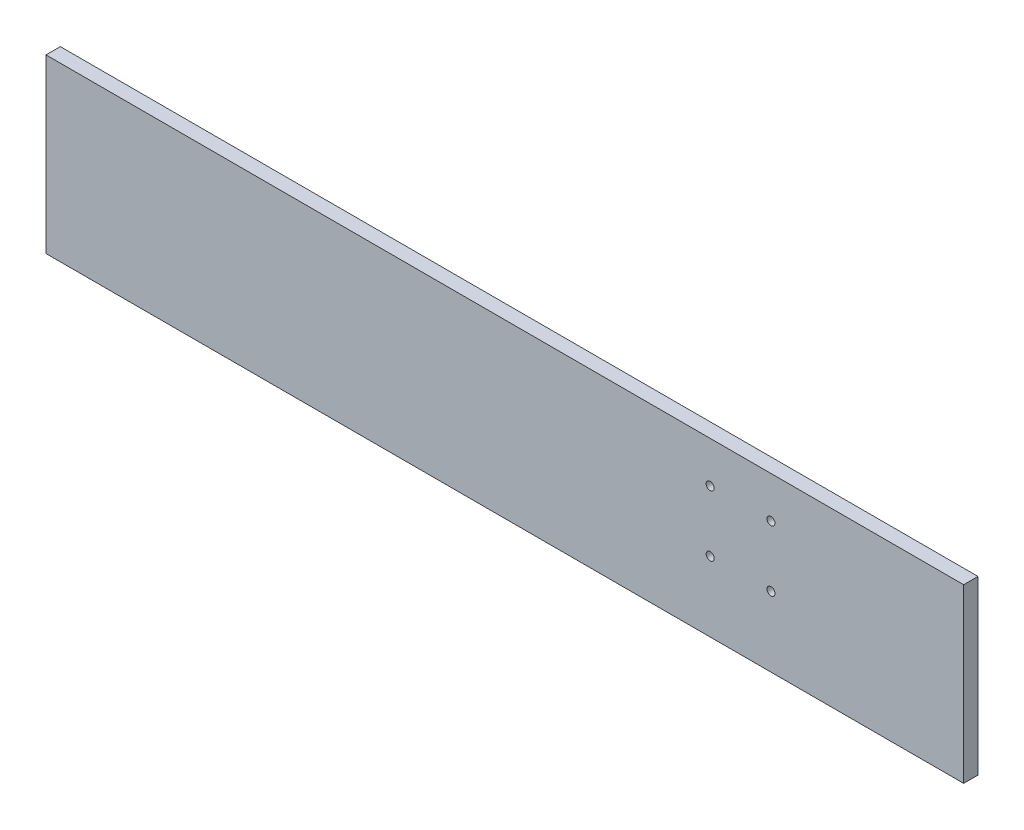
ISO-10303-21;
HEADER;
FILE_DESCRIPTION(('STEP AP214'),'2;1');
FILE_NAME('part.step','',(''),(''),'','','');
FILE_SCHEMA(('AUTOMOTIVE_DESIGN { 1 0 10303 214 1 1 1 1 }'));
ENDSEC;
DATA;
#1=APPLICATION_CONTEXT('core data for automotive mechanical design processes');
#2=APPLICATION_PROTOCOL_DEFINITION('international standard','automotive_design',2000,#1);
#3=PRODUCT_CONTEXT('',#1,'mechanical');
#4=PRODUCT('Part','Part','',(#3));
#5=PRODUCT_RELATED_PRODUCT_CATEGORY('part','',(#4));
#6=PRODUCT_DEFINITION_FORMATION('','',#4);
#7=PRODUCT_DEFINITION_CONTEXT('part definition',#1,'design');
#8=PRODUCT_DEFINITION('design','',#6,#7);
#9=PRODUCT_DEFINITION_SHAPE('','',#8);
#10=(LENGTH_UNIT() NAMED_UNIT(*) SI_UNIT(.MILLI.,.METRE.));
#11=(NAMED_UNIT(*) PLANE_ANGLE_UNIT() SI_UNIT($,.RADIAN.));
#12=(NAMED_UNIT(*) SI_UNIT($,.STERADIAN.) SOLID_ANGLE_UNIT());
#13=UNCERTAINTY_MEASURE_WITH_UNIT(LENGTH_MEASURE(1.E-05),#10,'distance_accuracy_value','');
#14=(GEOMETRIC_REPRESENTATION_CONTEXT(3) GLOBAL_UNCERTAINTY_ASSIGNED_CONTEXT((#13)) GLOBAL_UNIT_ASSIGNED_CONTEXT((#10,
#11,#12)) REPRESENTATION_CONTEXT('',''));
#15=CARTESIAN_POINT('',(0.,0.,0.));
#16=DIRECTION('',(0.,0.,1.));
#17=DIRECTION('',(1.,0.,0.));
#18=AXIS2_PLACEMENT_3D('',#15,#16,#17);
#19=CARTESIAN_POINT('',(0.,0.,6.35));
#20=DIRECTION('',(1.,0.,0.));
#21=DIRECTION('',(0.,0.,-1.));
#22=AXIS2_PLACEMENT_3D('',#19,#20,#21);
#23=PLANE('',#22);
#24=DIRECTION('',(0.,-1.,0.));
#25=VECTOR('',#24,1.);
#26=CARTESIAN_POINT('',(0.,0.,0.));
#27=LINE('',#26,#25);
#28=CARTESIAN_POINT('',(0.,76.2,0.));
#29=VERTEX_POINT('',#28);
#30=CARTESIAN_POINT('',(0.,0.,0.));
#31=VERTEX_POINT('',#30);
#32=EDGE_CURVE('E99',#29,#31,#27,.T.);
#33=ORIENTED_EDGE('',*,*,#32,.T.);
#34=DIRECTION('',(0.,0.,-1.));
#35=VECTOR('',#34,1.);
#36=CARTESIAN_POINT('',(0.,0.,6.35));
#37=LINE('',#36,#35);
#38=CARTESIAN_POINT('',(0.,0.,6.35));
#39=VERTEX_POINT('',#38);
#40=EDGE_CURVE('E11',#39,#31,#37,.T.);
#41=ORIENTED_EDGE('',*,*,#40,.F.);
#42=DIRECTION('',(0.,-1.,0.));
#43=VECTOR('',#42,1.);
#44=CARTESIAN_POINT('',(0.,0.,6.35));
#45=LINE('',#44,#43);
#46=CARTESIAN_POINT('',(0.,76.2,6.35));
#47=VERTEX_POINT('',#46);
#48=EDGE_CURVE('E86',#47,#39,#45,.T.);
#49=ORIENTED_EDGE('',*,*,#48,.F.);
#50=DIRECTION('',(0.,0.,-1.));
#51=VECTOR('',#50,1.);
#52=CARTESIAN_POINT('',(0.,76.2,6.35));
#53=LINE('',#52,#51);
#54=EDGE_CURVE('E95',#47,#29,#53,.T.);
#55=ORIENTED_EDGE('',*,*,#54,.T.);
#56=EDGE_LOOP('',(#33,#41,#49,#55));
#57=FACE_BOUND('',#56,.T.);
#58=ADVANCED_FACE('F33',(#57),#23,.F.);
#59=CARTESIAN_POINT('',(0.,0.,6.35));
#60=DIRECTION('',(0.,1.,0.));
#61=DIRECTION('',(0.,0.,1.));
#62=AXIS2_PLACEMENT_3D('',#59,#60,#61);
#63=PLANE('',#62);
#64=DIRECTION('',(1.,0.,0.));
#65=VECTOR('',#64,1.);
#66=CARTESIAN_POINT('',(0.,0.,0.));
#67=LINE('',#66,#65);
#68=CARTESIAN_POINT('',(406.4,0.,0.));
#69=VERTEX_POINT('',#68);
#70=EDGE_CURVE('E90',#31,#69,#67,.T.);
#71=ORIENTED_EDGE('',*,*,#70,.T.);
#72=DIRECTION('',(0.,0.,-1.));
#73=VECTOR('',#72,1.);
#74=CARTESIAN_POINT('',(406.4,0.,6.35));
#75=LINE('',#74,#73);
#76=CARTESIAN_POINT('',(406.4,0.,6.35));
#77=VERTEX_POINT('',#76);
#78=EDGE_CURVE('E42',#77,#69,#75,.T.);
#79=ORIENTED_EDGE('',*,*,#78,.F.);
#80=DIRECTION('',(1.,0.,0.));
#81=VECTOR('',#80,1.);
#82=CARTESIAN_POINT('',(0.,0.,6.35));
#83=LINE('',#82,#81);
#84=EDGE_CURVE('E81',#39,#77,#83,.T.);
#85=ORIENTED_EDGE('',*,*,#84,.F.);
#86=ORIENTED_EDGE('',*,*,#40,.T.);
#87=EDGE_LOOP('',(#71,#79,#85,#86));
#88=FACE_BOUND('',#87,.T.);
#89=ADVANCED_FACE('F89',(#88),#63,.F.);
#90=CARTESIAN_POINT('',(406.4,0.,6.35));
#91=DIRECTION('',(-1.,0.,0.));
#92=DIRECTION('',(0.,0.,1.));
#93=AXIS2_PLACEMENT_3D('',#90,#91,#92);
#94=PLANE('',#93);
#95=DIRECTION('',(0.,1.,0.));
#96=VECTOR('',#95,1.);
#97=CARTESIAN_POINT('',(406.4,0.,0.));
#98=LINE('',#97,#96);
#99=CARTESIAN_POINT('',(406.4,76.2,0.));
#100=VERTEX_POINT('',#99);
#101=EDGE_CURVE('E68',#69,#100,#98,.T.);
#102=ORIENTED_EDGE('',*,*,#101,.T.);
#103=DIRECTION('',(0.,0.,-1.));
#104=VECTOR('',#103,1.);
#105=CARTESIAN_POINT('',(406.4,76.2,6.35));
#106=LINE('',#105,#104);
#107=CARTESIAN_POINT('',(406.4,76.2,6.35));
#108=VERTEX_POINT('',#107);
#109=EDGE_CURVE('E91',#108,#100,#106,.T.);
#110=ORIENTED_EDGE('',*,*,#109,.F.);
#111=DIRECTION('',(0.,1.,0.));
#112=VECTOR('',#111,1.);
#113=CARTESIAN_POINT('',(406.4,0.,6.35));
#114=LINE('',#113,#112);
#115=EDGE_CURVE('E84',#77,#108,#114,.T.);
#116=ORIENTED_EDGE('',*,*,#115,.F.);
#117=ORIENTED_EDGE('',*,*,#78,.T.);
#118=EDGE_LOOP('',(#102,#110,#116,#117));
#119=FACE_BOUND('',#118,.T.);
#120=ADVANCED_FACE('F93',(#119),#94,.F.);
#121=CARTESIAN_POINT('',(0.,76.2,6.35));
#122=DIRECTION('',(0.,-1.,0.));
#123=DIRECTION('',(0.,0.,-1.));
#124=AXIS2_PLACEMENT_3D('',#121,#122,#123);
#125=PLANE('',#124);
#126=DIRECTION('',(-1.,0.,0.));
#127=VECTOR('',#126,1.);
#128=CARTESIAN_POINT('',(0.,76.2,0.));
#129=LINE('',#128,#127);
#130=EDGE_CURVE('E74',#100,#29,#129,.T.);
#131=ORIENTED_EDGE('',*,*,#130,.T.);
#132=ORIENTED_EDGE('',*,*,#54,.F.);
#133=DIRECTION('',(-1.,0.,0.));
#134=VECTOR('',#133,1.);
#135=CARTESIAN_POINT('',(0.,76.2,6.35));
#136=LINE('',#135,#134);
#137=EDGE_CURVE('E51',#108,#47,#136,.T.);
#138=ORIENTED_EDGE('',*,*,#137,.F.);
#139=ORIENTED_EDGE('',*,*,#109,.T.);
#140=EDGE_LOOP('',(#131,#132,#138,#139));
#141=FACE_BOUND('',#140,.T.);
#142=ADVANCED_FACE('F136',(#141),#125,.F.);
#143=CARTESIAN_POINT('',(0.,0.,6.35));
#144=DIRECTION('',(0.,0.,-1.));
#145=DIRECTION('',(-1.,0.,0.));
#146=AXIS2_PLACEMENT_3D('',#143,#144,#145);
#147=PLANE('',#146);
#148=CARTESIAN_POINT('',(294.134855181895,30.9963258249364,6.35));
#149=DIRECTION('',(0.,0.,1.));
#150=DIRECTION('',(1.,0.,0.));
#151=AXIS2_PLACEMENT_3D('',#148,#149,#150);
#152=CIRCLE('',#151,1.77800000000003);
#153=CARTESIAN_POINT('',(295.912855181895,30.9963258249364,6.35));
#154=VERTEX_POINT('',#153);
#155=EDGE_CURVE('E126',#154,#154,#152,.T.);
#156=ORIENTED_EDGE('',*,*,#155,.F.);
#157=EDGE_LOOP('',(#156));
#158=FACE_BOUND('',#157,.T.);
#159=CARTESIAN_POINT('',(321.075614175064,31.0187951818949,6.35));
#160=DIRECTION('',(0.,0.,1.));
#161=DIRECTION('',(1.,0.,0.));
#162=AXIS2_PLACEMENT_3D('',#159,#160,#161);
#163=CIRCLE('',#162,1.77799999999998);
#164=CARTESIAN_POINT('',(322.853614175064,31.0187951818949,6.35));
#165=VERTEX_POINT('',#164);
#166=EDGE_CURVE('E116',#165,#165,#163,.T.);
#167=ORIENTED_EDGE('',*,*,#166,.F.);
#168=EDGE_LOOP('',(#167));
#169=FACE_BOUND('',#168,.T.);
#170=CARTESIAN_POINT('',(321.053144818105,57.9595541750637,6.35));
#171=DIRECTION('',(0.,0.,1.));
#172=DIRECTION('',(1.,0.,0.));
#173=AXIS2_PLACEMENT_3D('',#170,#171,#172);
#174=CIRCLE('',#173,1.77799999999998);
#175=CARTESIAN_POINT('',(322.831144818105,57.9595541750637,6.35));
#176=VERTEX_POINT('',#175);
#177=EDGE_CURVE('E113',#176,#176,#174,.T.);
#178=ORIENTED_EDGE('',*,*,#177,.F.);
#179=EDGE_LOOP('',(#178));
#180=FACE_BOUND('',#179,.T.);
#181=CARTESIAN_POINT('',(294.112385824937,57.9370848181051,6.35));
#182=DIRECTION('',(0.,0.,1.));
#183=DIRECTION('',(1.,0.,0.));
#184=AXIS2_PLACEMENT_3D('',#181,#182,#183);
#185=CIRCLE('',#184,1.77800000000004);
#186=CARTESIAN_POINT('',(295.890385824937,57.9370848181051,6.35));
#187=VERTEX_POINT('',#186);
#188=EDGE_CURVE('E110',#187,#187,#185,.T.);
#189=ORIENTED_EDGE('',*,*,#188,.F.);
#190=EDGE_LOOP('',(#189));
#191=FACE_BOUND('',#190,.T.);
#192=ORIENTED_EDGE('',*,*,#48,.T.);
#193=ORIENTED_EDGE('',*,*,#84,.T.);
#194=ORIENTED_EDGE('',*,*,#115,.T.);
#195=ORIENTED_EDGE('',*,*,#137,.T.);
#196=EDGE_LOOP('',(#192,#193,#194,#195));
#197=FACE_BOUND('',#196,.T.);
#198=ADVANCED_FACE('F82',(#158,#169,#180,#191,#197),#147,.F.);
#199=CARTESIAN_POINT('',(0.,0.,0.));
#200=DIRECTION('',(0.,0.,-1.));
#201=DIRECTION('',(-1.,0.,0.));
#202=AXIS2_PLACEMENT_3D('',#199,#200,#201);
#203=PLANE('',#202);
#204=CARTESIAN_POINT('',(294.134855181895,30.9963258249364,0.));
#205=DIRECTION('',(0.,0.,-1.));
#206=DIRECTION('',(-1.,0.,0.));
#207=AXIS2_PLACEMENT_3D('',#204,#205,#206);
#208=CIRCLE('',#207,1.77800000000003);
#209=CARTESIAN_POINT('',(292.356855181895,30.9963258249364,0.));
#210=VERTEX_POINT('',#209);
#211=EDGE_CURVE('E36',#210,#210,#208,.T.);
#212=ORIENTED_EDGE('',*,*,#211,.F.);
#213=EDGE_LOOP('',(#212));
#214=FACE_BOUND('',#213,.T.);
#215=CARTESIAN_POINT('',(321.075614175064,31.0187951818949,0.));
#216=DIRECTION('',(0.,0.,-1.));
#217=DIRECTION('',(-1.,0.,0.));
#218=AXIS2_PLACEMENT_3D('',#215,#216,#217);
#219=CIRCLE('',#218,1.77799999999998);
#220=CARTESIAN_POINT('',(319.297614175064,31.0187951818949,0.));
#221=VERTEX_POINT('',#220);
#222=EDGE_CURVE('E114',#221,#221,#219,.T.);
#223=ORIENTED_EDGE('',*,*,#222,.F.);
#224=EDGE_LOOP('',(#223));
#225=FACE_BOUND('',#224,.T.);
#226=CARTESIAN_POINT('',(321.053144818105,57.9595541750637,0.));
#227=DIRECTION('',(0.,0.,-1.));
#228=DIRECTION('',(-1.,0.,0.));
#229=AXIS2_PLACEMENT_3D('',#226,#227,#228);
#230=CIRCLE('',#229,1.77799999999998);
#231=CARTESIAN_POINT('',(319.275144818105,57.9595541750637,0.));
#232=VERTEX_POINT('',#231);
#233=EDGE_CURVE('E111',#232,#232,#230,.T.);
#234=ORIENTED_EDGE('',*,*,#233,.F.);
#235=EDGE_LOOP('',(#234));
#236=FACE_BOUND('',#235,.T.);
#237=CARTESIAN_POINT('',(294.112385824937,57.9370848181051,0.));
#238=DIRECTION('',(0.,0.,-1.));
#239=DIRECTION('',(-1.,0.,0.));
#240=AXIS2_PLACEMENT_3D('',#237,#238,#239);
#241=CIRCLE('',#240,1.77800000000004);
#242=CARTESIAN_POINT('',(292.334385824937,57.9370848181051,0.));
#243=VERTEX_POINT('',#242);
#244=EDGE_CURVE('E102',#243,#243,#241,.T.);
#245=ORIENTED_EDGE('',*,*,#244,.F.);
#246=EDGE_LOOP('',(#245));
#247=FACE_BOUND('',#246,.T.);
#248=ORIENTED_EDGE('',*,*,#32,.F.);
#249=ORIENTED_EDGE('',*,*,#130,.F.);
#250=ORIENTED_EDGE('',*,*,#101,.F.);
#251=ORIENTED_EDGE('',*,*,#70,.F.);
#252=EDGE_LOOP('',(#248,#249,#250,#251));
#253=FACE_BOUND('',#252,.T.);
#254=ADVANCED_FACE('F135',(#214,#225,#236,#247,#253),#203,.T.);
#255=CARTESIAN_POINT('',(294.112385824937,57.9370848181051,-3.81));
#256=DIRECTION('',(0.,0.,1.));
#257=DIRECTION('',(1.,0.,0.));
#258=AXIS2_PLACEMENT_3D('',#255,#256,#257);
#259=CYLINDRICAL_SURFACE('',#258,1.77800000000004);
#260=ORIENTED_EDGE('',*,*,#244,.T.);
#261=EDGE_LOOP('',(#260));
#262=FACE_BOUND('',#261,.T.);
#263=ORIENTED_EDGE('',*,*,#188,.T.);
#264=EDGE_LOOP('',(#263));
#265=FACE_BOUND('',#264,.T.);
#266=ADVANCED_FACE('F132',(#262,#265),#259,.F.);
#267=CARTESIAN_POINT('',(321.053144818105,57.9595541750637,-3.81));
#268=DIRECTION('',(0.,0.,1.));
#269=DIRECTION('',(1.,0.,0.));
#270=AXIS2_PLACEMENT_3D('',#267,#268,#269);
#271=CYLINDRICAL_SURFACE('',#270,1.77799999999998);
#272=ORIENTED_EDGE('',*,*,#233,.T.);
#273=EDGE_LOOP('',(#272));
#274=FACE_BOUND('',#273,.T.);
#275=ORIENTED_EDGE('',*,*,#177,.T.);
#276=EDGE_LOOP('',(#275));
#277=FACE_BOUND('',#276,.T.);
#278=ADVANCED_FACE('F183',(#274,#277),#271,.F.);
#279=CARTESIAN_POINT('',(321.075614175064,31.0187951818949,-3.81));
#280=DIRECTION('',(0.,0.,1.));
#281=DIRECTION('',(1.,0.,0.));
#282=AXIS2_PLACEMENT_3D('',#279,#280,#281);
#283=CYLINDRICAL_SURFACE('',#282,1.77799999999998);
#284=ORIENTED_EDGE('',*,*,#222,.T.);
#285=EDGE_LOOP('',(#284));
#286=FACE_BOUND('',#285,.T.);
#287=ORIENTED_EDGE('',*,*,#166,.T.);
#288=EDGE_LOOP('',(#287));
#289=FACE_BOUND('',#288,.T.);
#290=ADVANCED_FACE('F189',(#286,#289),#283,.F.);
#291=CARTESIAN_POINT('',(294.134855181895,30.9963258249364,-3.81));
#292=DIRECTION('',(0.,0.,1.));
#293=DIRECTION('',(1.,0.,0.));
#294=AXIS2_PLACEMENT_3D('',#291,#292,#293);
#295=CYLINDRICAL_SURFACE('',#294,1.77800000000003);
#296=ORIENTED_EDGE('',*,*,#211,.T.);
#297=EDGE_LOOP('',(#296));
#298=FACE_BOUND('',#297,.T.);
#299=ORIENTED_EDGE('',*,*,#155,.T.);
#300=EDGE_LOOP('',(#299));
#301=FACE_BOUND('',#300,.T.);
#302=ADVANCED_FACE('F197',(#298,#301),#295,.F.);
#303=CLOSED_SHELL('',(#58,#89,#120,#142,#198,#254,#266,#278,#290,#302));
#304=MANIFOLD_SOLID_BREP('B2',#303);
#305=ADVANCED_BREP_SHAPE_REPRESENTATION('',(#18,#304),#14);
#306=SHAPE_DEFINITION_REPRESENTATION(#9,#305);
ENDSEC;
END-ISO-10303-21;
